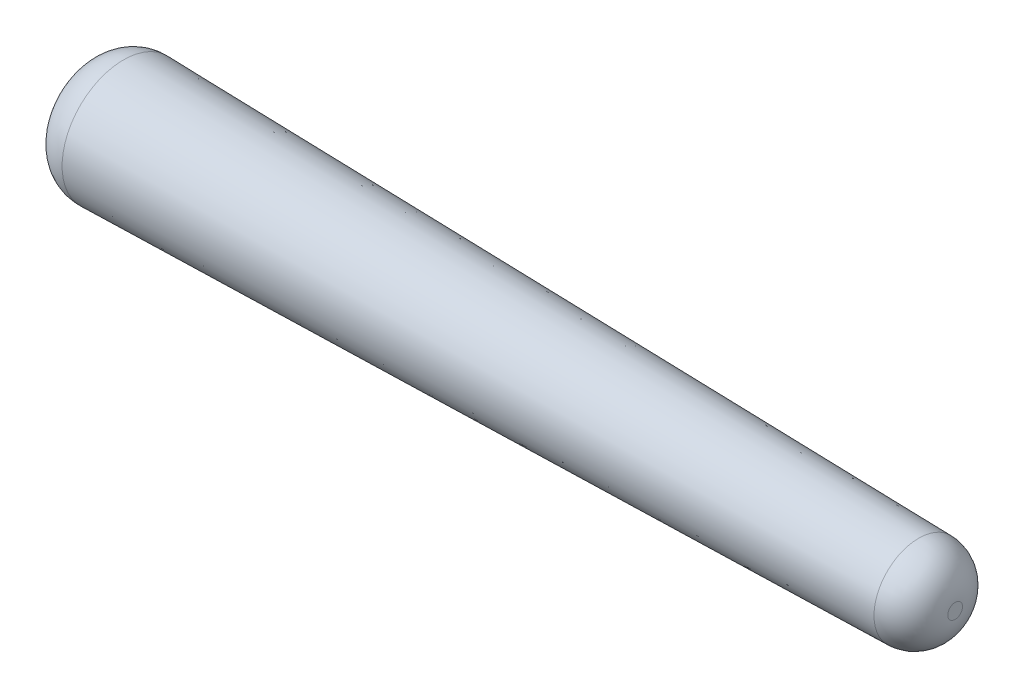
ISO-10303-21;
HEADER;
FILE_DESCRIPTION(('STEP AP214'),'2;1');
FILE_NAME('part.step','',(''),(''),'','','');
FILE_SCHEMA(('AUTOMOTIVE_DESIGN { 1 0 10303 214 1 1 1 1 }'));
ENDSEC;
DATA;
#1=APPLICATION_CONTEXT('core data for automotive mechanical design processes');
#2=APPLICATION_PROTOCOL_DEFINITION('international standard','automotive_design',2000,#1);
#3=PRODUCT_CONTEXT('',#1,'mechanical');
#4=PRODUCT('Part','Part','',(#3));
#5=PRODUCT_RELATED_PRODUCT_CATEGORY('part','',(#4));
#6=PRODUCT_DEFINITION_FORMATION('','',#4);
#7=PRODUCT_DEFINITION_CONTEXT('part definition',#1,'design');
#8=PRODUCT_DEFINITION('design','',#6,#7);
#9=PRODUCT_DEFINITION_SHAPE('','',#8);
#10=(LENGTH_UNIT() NAMED_UNIT(*) SI_UNIT(.MILLI.,.METRE.));
#11=(NAMED_UNIT(*) PLANE_ANGLE_UNIT() SI_UNIT($,.RADIAN.));
#12=(NAMED_UNIT(*) SI_UNIT($,.STERADIAN.) SOLID_ANGLE_UNIT());
#13=UNCERTAINTY_MEASURE_WITH_UNIT(LENGTH_MEASURE(1.E-05),#10,'distance_accuracy_value','');
#14=(GEOMETRIC_REPRESENTATION_CONTEXT(3) GLOBAL_UNCERTAINTY_ASSIGNED_CONTEXT((#13)) GLOBAL_UNIT_ASSIGNED_CONTEXT((#10,
#11,#12)) REPRESENTATION_CONTEXT('',''));
#15=CARTESIAN_POINT('',(0.,0.,0.));
#16=DIRECTION('',(0.,0.,1.));
#17=DIRECTION('',(1.,0.,0.));
#18=AXIS2_PLACEMENT_3D('',#15,#16,#17);
#19=CARTESIAN_POINT('',(-3.5,0.,0.));
#20=DIRECTION('',(-1.,0.,0.));
#21=DIRECTION('',(0.,0.,-1.));
#22=AXIS2_PLACEMENT_3D('',#19,#20,#21);
#23=CONICAL_SURFACE('',#22,0.5,0.020943951023932);
#24=CARTESIAN_POINT('',(-3.19371727403499,0.,0.));
#25=DIRECTION('',(1.,0.,0.));
#26=DIRECTION('',(0.,0.,-1.));
#27=AXIS2_PLACEMENT_3D('',#24,#25,#26);
#28=CIRCLE('',#27,0.493584291478922);
#29=CARTESIAN_POINT('',(-3.19371727403499,0.,-0.493584291478922));
#30=VERTEX_POINT('',#29);
#31=EDGE_CURVE('E43',#30,#30,#28,.T.);
#32=ORIENTED_EDGE('',*,*,#31,.T.);
#33=EDGE_LOOP('',(#32));
#34=FACE_BOUND('',#33,.T.);
#35=CARTESIAN_POINT('',(3.20628272596501,0.,0.));
#36=DIRECTION('',(-1.,0.,0.));
#37=DIRECTION('',(0.,0.,1.));
#38=AXIS2_PLACEMENT_3D('',#35,#36,#37);
#39=CIRCLE('',#38,0.359523402457098);
#40=CARTESIAN_POINT('',(3.20628272596501,0.,0.359523402457098));
#41=VERTEX_POINT('',#40);
#42=EDGE_CURVE('E47',#41,#41,#39,.T.);
#43=ORIENTED_EDGE('',*,*,#42,.T.);
#44=EDGE_LOOP('',(#43));
#45=FACE_BOUND('',#44,.T.);
#46=ADVANCED_FACE('F32',(#34,#45),#23,.T.);
#47=CARTESIAN_POINT('',(3.5,0.,0.));
#48=DIRECTION('',(1.,0.,0.));
#49=DIRECTION('',(0.,0.,-1.));
#50=AXIS2_PLACEMENT_3D('',#47,#48,#49);
#51=PLANE('',#50);
#52=CARTESIAN_POINT('',(3.5,0.,0.));
#53=DIRECTION('',(1.,0.,0.));
#54=DIRECTION('',(0.,0.,-1.));
#55=AXIS2_PLACEMENT_3D('',#52,#53,#54);
#56=CIRCLE('',#55,0.0595891974146444);
#57=CARTESIAN_POINT('',(3.5,0.,-0.0595891974146444));
#58=VERTEX_POINT('',#57);
#59=EDGE_CURVE('E10',#58,#58,#56,.T.);
#60=ORIENTED_EDGE('',*,*,#59,.T.);
#61=EDGE_LOOP('',(#60));
#62=FACE_BOUND('',#61,.T.);
#63=ADVANCED_FACE('F63',(#62),#51,.T.);
#64=CARTESIAN_POINT('',(-3.5,0.,0.));
#65=DIRECTION('',(1.,0.,0.));
#66=DIRECTION('',(0.,0.,-1.));
#67=AXIS2_PLACEMENT_3D('',#64,#65,#66);
#68=PLANE('',#67);
#69=CARTESIAN_POINT('',(-3.5,0.,0.));
#70=DIRECTION('',(1.,0.,0.));
#71=DIRECTION('',(0.,0.,-1.));
#72=AXIS2_PLACEMENT_3D('',#69,#70,#71);
#73=CIRCLE('',#72,0.193650086436469);
#74=CARTESIAN_POINT('',(-3.5,0.,-0.193650086436469));
#75=VERTEX_POINT('',#74);
#76=EDGE_CURVE('E39',#75,#75,#73,.F.);
#77=ORIENTED_EDGE('',*,*,#76,.T.);
#78=EDGE_LOOP('',(#77));
#79=FACE_BOUND('',#78,.T.);
#80=ADVANCED_FACE('F60',(#79),#68,.F.);
#81=CARTESIAN_POINT('',(-3.2,0.,0.));
#82=DIRECTION('',(1.,0.,0.));
#83=DIRECTION('',(0.,0.,-1.));
#84=AXIS2_PLACEMENT_3D('',#81,#82,#83);
#85=DEGENERATE_TOROIDAL_SURFACE('',#84,0.193650086436469,0.3,.T.);
#86=ORIENTED_EDGE('',*,*,#76,.F.);
#87=EDGE_LOOP('',(#86));
#88=FACE_BOUND('',#87,.T.);
#89=ORIENTED_EDGE('',*,*,#31,.F.);
#90=EDGE_LOOP('',(#89));
#91=FACE_BOUND('',#90,.T.);
#92=ADVANCED_FACE('F56',(#88,#91),#85,.T.);
#93=CARTESIAN_POINT('',(3.2,0.,0.));
#94=DIRECTION('',(1.,0.,0.));
#95=DIRECTION('',(0.,0.,-1.));
#96=AXIS2_PLACEMENT_3D('',#93,#94,#95);
#97=DEGENERATE_TOROIDAL_SURFACE('',#96,0.0595891974146444,0.3,.T.);
#98=ORIENTED_EDGE('',*,*,#42,.F.);
#99=EDGE_LOOP('',(#98));
#100=FACE_BOUND('',#99,.T.);
#101=ORIENTED_EDGE('',*,*,#59,.F.);
#102=EDGE_LOOP('',(#101));
#103=FACE_BOUND('',#102,.T.);
#104=ADVANCED_FACE('F34',(#100,#103),#97,.T.);
#105=CLOSED_SHELL('',(#46,#63,#80,#92,#104));
#106=MANIFOLD_SOLID_BREP('B2',#105);
#107=ADVANCED_BREP_SHAPE_REPRESENTATION('',(#18,#106),#14);
#108=SHAPE_DEFINITION_REPRESENTATION(#9,#107);
ENDSEC;
END-ISO-10303-21;
